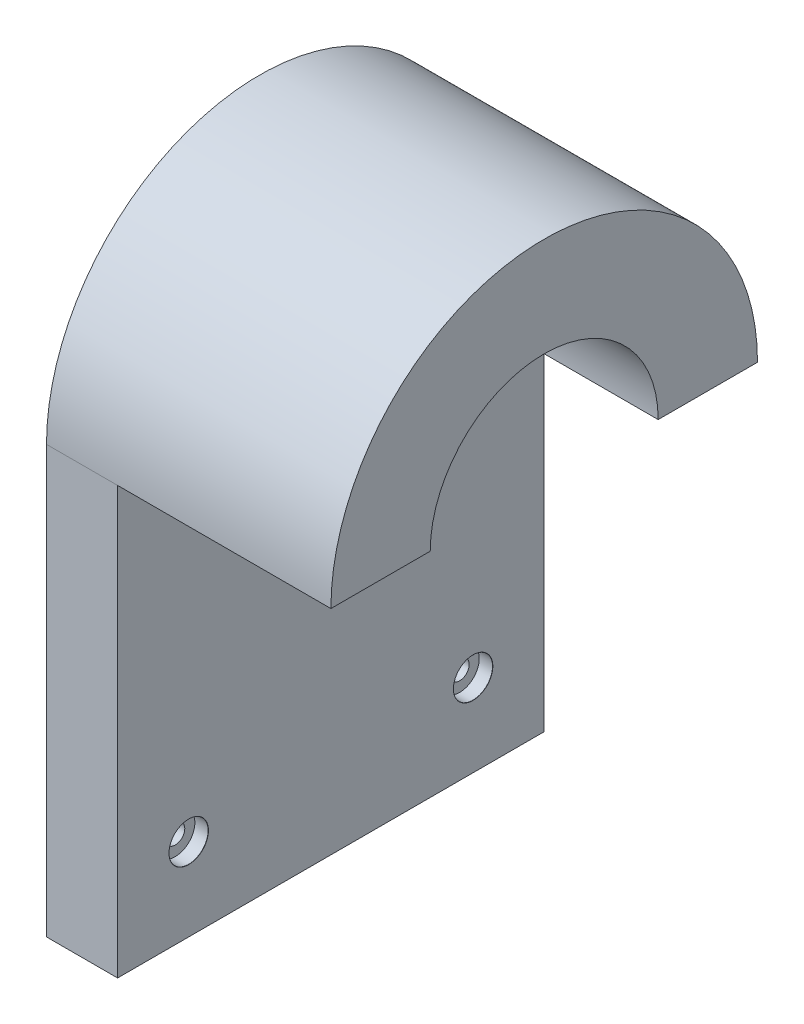
ISO-10303-21;
HEADER;
FILE_DESCRIPTION(('STEP AP214'),'2;1');
FILE_NAME('part.step','',(''),(''),'','','');
FILE_SCHEMA(('AUTOMOTIVE_DESIGN { 1 0 10303 214 1 1 1 1 }'));
ENDSEC;
DATA;
#1=APPLICATION_CONTEXT('core data for automotive mechanical design processes');
#2=APPLICATION_PROTOCOL_DEFINITION('international standard','automotive_design',2000,#1);
#3=PRODUCT_CONTEXT('',#1,'mechanical');
#4=PRODUCT('Part','Part','',(#3));
#5=PRODUCT_RELATED_PRODUCT_CATEGORY('part','',(#4));
#6=PRODUCT_DEFINITION_FORMATION('','',#4);
#7=PRODUCT_DEFINITION_CONTEXT('part definition',#1,'design');
#8=PRODUCT_DEFINITION('design','',#6,#7);
#9=PRODUCT_DEFINITION_SHAPE('','',#8);
#10=(LENGTH_UNIT() NAMED_UNIT(*) SI_UNIT(.MILLI.,.METRE.));
#11=(NAMED_UNIT(*) PLANE_ANGLE_UNIT() SI_UNIT($,.RADIAN.));
#12=(NAMED_UNIT(*) SI_UNIT($,.STERADIAN.) SOLID_ANGLE_UNIT());
#13=UNCERTAINTY_MEASURE_WITH_UNIT(LENGTH_MEASURE(1.E-05),#10,'distance_accuracy_value','');
#14=(GEOMETRIC_REPRESENTATION_CONTEXT(3) GLOBAL_UNCERTAINTY_ASSIGNED_CONTEXT((#13)) GLOBAL_UNIT_ASSIGNED_CONTEXT((#10,
#11,#12)) REPRESENTATION_CONTEXT('',''));
#15=CARTESIAN_POINT('',(0.,0.,0.));
#16=DIRECTION('',(0.,0.,1.));
#17=DIRECTION('',(1.,0.,0.));
#18=AXIS2_PLACEMENT_3D('',#15,#16,#17);
#19=CARTESIAN_POINT('',(12.7,0.,38.1));
#20=DIRECTION('',(0.,0.,-1.));
#21=DIRECTION('',(-1.,0.,0.));
#22=AXIS2_PLACEMENT_3D('',#19,#20,#21);
#23=PLANE('',#22);
#24=DIRECTION('',(0.,-1.,0.));
#25=VECTOR('',#24,1.);
#26=CARTESIAN_POINT('',(0.,0.,38.1));
#27=LINE('',#26,#25);
#28=CARTESIAN_POINT('',(0.,0.,38.1));
#29=VERTEX_POINT('',#28);
#30=CARTESIAN_POINT('',(0.,-76.2,38.1));
#31=VERTEX_POINT('',#30);
#32=EDGE_CURVE('E151',#29,#31,#27,.T.);
#33=ORIENTED_EDGE('',*,*,#32,.T.);
#34=DIRECTION('',(-1.,0.,0.));
#35=VECTOR('',#34,1.);
#36=CARTESIAN_POINT('',(12.7,-76.2,38.1));
#37=LINE('',#36,#35);
#38=CARTESIAN_POINT('',(12.7,-76.2,38.1));
#39=VERTEX_POINT('',#38);
#40=EDGE_CURVE('E59',#39,#31,#37,.T.);
#41=ORIENTED_EDGE('',*,*,#40,.F.);
#42=DIRECTION('',(0.,-1.,0.));
#43=VECTOR('',#42,1.);
#44=CARTESIAN_POINT('',(12.7,0.,38.1));
#45=LINE('',#44,#43);
#46=CARTESIAN_POINT('',(12.7,0.,38.1));
#47=VERTEX_POINT('',#46);
#48=EDGE_CURVE('E143',#47,#39,#45,.T.);
#49=ORIENTED_EDGE('',*,*,#48,.F.);
#50=DIRECTION('',(-1.,0.,0.));
#51=VECTOR('',#50,1.);
#52=CARTESIAN_POINT('',(12.7,0.,38.1));
#53=LINE('',#52,#51);
#54=EDGE_CURVE('E12',#47,#29,#53,.T.);
#55=ORIENTED_EDGE('',*,*,#54,.T.);
#56=EDGE_LOOP('',(#33,#41,#49,#55));
#57=FACE_BOUND('',#56,.T.);
#58=ADVANCED_FACE('F50',(#57),#23,.F.);
#59=CARTESIAN_POINT('',(12.7,-76.2,0.));
#60=DIRECTION('',(0.,1.,0.));
#61=DIRECTION('',(0.,0.,1.));
#62=AXIS2_PLACEMENT_3D('',#59,#60,#61);
#63=PLANE('',#62);
#64=DIRECTION('',(0.,0.,-1.));
#65=VECTOR('',#64,1.);
#66=CARTESIAN_POINT('',(0.,-76.2,0.));
#67=LINE('',#66,#65);
#68=CARTESIAN_POINT('',(0.,-76.2,-38.1));
#69=VERTEX_POINT('',#68);
#70=EDGE_CURVE('E153',#31,#69,#67,.T.);
#71=ORIENTED_EDGE('',*,*,#70,.T.);
#72=DIRECTION('',(-1.,0.,0.));
#73=VECTOR('',#72,1.);
#74=CARTESIAN_POINT('',(12.7,-76.2,-38.1));
#75=LINE('',#74,#73);
#76=CARTESIAN_POINT('',(12.7,-76.2,-38.1));
#77=VERTEX_POINT('',#76);
#78=EDGE_CURVE('E158',#77,#69,#75,.T.);
#79=ORIENTED_EDGE('',*,*,#78,.F.);
#80=DIRECTION('',(0.,0.,-1.));
#81=VECTOR('',#80,1.);
#82=CARTESIAN_POINT('',(12.7,-76.2,0.));
#83=LINE('',#82,#81);
#84=EDGE_CURVE('E145',#39,#77,#83,.T.);
#85=ORIENTED_EDGE('',*,*,#84,.F.);
#86=ORIENTED_EDGE('',*,*,#40,.T.);
#87=EDGE_LOOP('',(#71,#79,#85,#86));
#88=FACE_BOUND('',#87,.T.);
#89=ADVANCED_FACE('F166',(#88),#63,.F.);
#90=CARTESIAN_POINT('',(12.7,0.,-38.1));
#91=DIRECTION('',(0.,0.,1.));
#92=DIRECTION('',(1.,0.,0.));
#93=AXIS2_PLACEMENT_3D('',#90,#91,#92);
#94=PLANE('',#93);
#95=DIRECTION('',(0.,1.,0.));
#96=VECTOR('',#95,1.);
#97=CARTESIAN_POINT('',(0.,0.,-38.1));
#98=LINE('',#97,#96);
#99=CARTESIAN_POINT('',(0.,0.,-38.1));
#100=VERTEX_POINT('',#99);
#101=EDGE_CURVE('E146',#69,#100,#98,.T.);
#102=ORIENTED_EDGE('',*,*,#101,.T.);
#103=DIRECTION('',(-1.,0.,0.));
#104=VECTOR('',#103,1.);
#105=CARTESIAN_POINT('',(12.7,0.,-38.1));
#106=LINE('',#105,#104);
#107=CARTESIAN_POINT('',(12.7,0.,-38.1));
#108=VERTEX_POINT('',#107);
#109=EDGE_CURVE('E150',#108,#100,#106,.T.);
#110=ORIENTED_EDGE('',*,*,#109,.F.);
#111=DIRECTION('',(0.,1.,0.));
#112=VECTOR('',#111,1.);
#113=CARTESIAN_POINT('',(12.7,0.,-38.1));
#114=LINE('',#113,#112);
#115=EDGE_CURVE('E148',#77,#108,#114,.T.);
#116=ORIENTED_EDGE('',*,*,#115,.F.);
#117=ORIENTED_EDGE('',*,*,#78,.T.);
#118=EDGE_LOOP('',(#102,#110,#116,#117));
#119=FACE_BOUND('',#118,.T.);
#120=ADVANCED_FACE('F178',(#119),#94,.F.);
#121=CARTESIAN_POINT('',(0.,0.,0.));
#122=DIRECTION('',(1.,0.,0.));
#123=DIRECTION('',(0.,0.,-1.));
#124=AXIS2_PLACEMENT_3D('',#121,#122,#123);
#125=PLANE('',#124);
#126=CARTESIAN_POINT('',(0.,0.,0.));
#127=DIRECTION('',(1.,0.,0.));
#128=DIRECTION('',(0.,0.,-1.));
#129=AXIS2_PLACEMENT_3D('',#126,#127,#128);
#130=CIRCLE('',#129,1.7);
#131=CARTESIAN_POINT('',(0.,0.,-1.7));
#132=VERTEX_POINT('',#131);
#133=EDGE_CURVE('E274',#132,#132,#130,.T.);
#134=ORIENTED_EDGE('',*,*,#133,.T.);
#135=EDGE_LOOP('',(#134));
#136=FACE_BOUND('',#135,.T.);
#137=CARTESIAN_POINT('',(0.,-61.4783253893957,25.4));
#138=DIRECTION('',(1.,0.,0.));
#139=DIRECTION('',(0.,0.,-1.));
#140=AXIS2_PLACEMENT_3D('',#137,#138,#139);
#141=CIRCLE('',#140,1.7);
#142=CARTESIAN_POINT('',(0.,-61.4783253893957,23.7));
#143=VERTEX_POINT('',#142);
#144=EDGE_CURVE('E289',#143,#143,#141,.T.);
#145=ORIENTED_EDGE('',*,*,#144,.T.);
#146=EDGE_LOOP('',(#145));
#147=FACE_BOUND('',#146,.T.);
#148=CARTESIAN_POINT('',(0.,-61.4783253893957,-25.4));
#149=DIRECTION('',(1.,0.,0.));
#150=DIRECTION('',(0.,0.,-1.));
#151=AXIS2_PLACEMENT_3D('',#148,#149,#150);
#152=CIRCLE('',#151,1.7);
#153=CARTESIAN_POINT('',(0.,-61.4783253893957,-27.1));
#154=VERTEX_POINT('',#153);
#155=EDGE_CURVE('E132',#154,#154,#152,.T.);
#156=ORIENTED_EDGE('',*,*,#155,.T.);
#157=EDGE_LOOP('',(#156));
#158=FACE_BOUND('',#157,.T.);
#159=ORIENTED_EDGE('',*,*,#32,.F.);
#160=CARTESIAN_POINT('',(0.,0.,0.));
#161=DIRECTION('',(1.,0.,0.));
#162=DIRECTION('',(0.,0.,-1.));
#163=AXIS2_PLACEMENT_3D('',#160,#161,#162);
#164=CIRCLE('',#163,38.1);
#165=EDGE_CURVE('E54',#100,#29,#164,.T.);
#166=ORIENTED_EDGE('',*,*,#165,.F.);
#167=ORIENTED_EDGE('',*,*,#101,.F.);
#168=ORIENTED_EDGE('',*,*,#70,.F.);
#169=EDGE_LOOP('',(#159,#166,#167,#168));
#170=FACE_BOUND('',#169,.T.);
#171=ADVANCED_FACE('F173',(#136,#147,#158,#170),#125,.F.);
#172=CARTESIAN_POINT('',(12.7,0.,0.));
#173=DIRECTION('',(1.,0.,0.));
#174=DIRECTION('',(0.,0.,-1.));
#175=AXIS2_PLACEMENT_3D('',#172,#173,#174);
#176=PLANE('',#175);
#177=CARTESIAN_POINT('',(12.7,0.,0.));
#178=DIRECTION('',(1.,0.,0.));
#179=DIRECTION('',(0.,0.,-1.));
#180=AXIS2_PLACEMENT_3D('',#177,#178,#179);
#181=CIRCLE('',#180,3.525);
#182=CARTESIAN_POINT('',(12.7,0.,-3.525));
#183=VERTEX_POINT('',#182);
#184=EDGE_CURVE('E264',#183,#183,#181,.T.);
#185=ORIENTED_EDGE('',*,*,#184,.F.);
#186=EDGE_LOOP('',(#185));
#187=FACE_BOUND('',#186,.T.);
#188=CARTESIAN_POINT('',(12.7,-61.4783253893957,25.4));
#189=DIRECTION('',(1.,0.,0.));
#190=DIRECTION('',(0.,0.,-1.));
#191=AXIS2_PLACEMENT_3D('',#188,#189,#190);
#192=CIRCLE('',#191,3.525);
#193=CARTESIAN_POINT('',(12.7,-61.4783253893957,21.875));
#194=VERTEX_POINT('',#193);
#195=EDGE_CURVE('E277',#194,#194,#192,.T.);
#196=ORIENTED_EDGE('',*,*,#195,.F.);
#197=EDGE_LOOP('',(#196));
#198=FACE_BOUND('',#197,.T.);
#199=CARTESIAN_POINT('',(12.7,-61.4783253893957,-25.4));
#200=DIRECTION('',(1.,0.,0.));
#201=DIRECTION('',(0.,0.,-1.));
#202=AXIS2_PLACEMENT_3D('',#199,#200,#201);
#203=CIRCLE('',#202,3.525);
#204=CARTESIAN_POINT('',(12.7,-61.4783253893957,-28.925));
#205=VERTEX_POINT('',#204);
#206=EDGE_CURVE('E292',#205,#205,#203,.T.);
#207=ORIENTED_EDGE('',*,*,#206,.F.);
#208=EDGE_LOOP('',(#207));
#209=FACE_BOUND('',#208,.T.);
#210=DIRECTION('',(0.,0.,-1.));
#211=VECTOR('',#210,1.);
#212=CARTESIAN_POINT('',(12.7,0.,0.));
#213=LINE('',#212,#211);
#214=CARTESIAN_POINT('',(12.7,0.,20.3583896772897));
#215=VERTEX_POINT('',#214);
#216=EDGE_CURVE('E127',#47,#215,#213,.T.);
#217=ORIENTED_EDGE('',*,*,#216,.F.);
#218=ORIENTED_EDGE('',*,*,#48,.T.);
#219=ORIENTED_EDGE('',*,*,#84,.T.);
#220=ORIENTED_EDGE('',*,*,#115,.T.);
#221=CARTESIAN_POINT('',(12.7,0.,-20.3583896772897));
#222=VERTEX_POINT('',#221);
#223=EDGE_CURVE('E71',#222,#108,#213,.T.);
#224=ORIENTED_EDGE('',*,*,#223,.F.);
#225=CARTESIAN_POINT('',(12.7,0.,0.));
#226=DIRECTION('',(1.,0.,0.));
#227=DIRECTION('',(0.,0.,-1.));
#228=AXIS2_PLACEMENT_3D('',#225,#226,#227);
#229=CIRCLE('',#228,20.3583896772897);
#230=EDGE_CURVE('E66',#222,#215,#229,.T.);
#231=ORIENTED_EDGE('',*,*,#230,.T.);
#232=EDGE_LOOP('',(#217,#218,#219,#220,#224,#231));
#233=FACE_BOUND('',#232,.T.);
#234=ADVANCED_FACE('F180',(#187,#198,#209,#233),#176,.T.);
#235=CARTESIAN_POINT('',(12.7,0.,0.));
#236=DIRECTION('',(-1.,0.,0.));
#237=DIRECTION('',(0.,0.,1.));
#238=AXIS2_PLACEMENT_3D('',#235,#236,#237);
#239=CYLINDRICAL_SURFACE('',#238,38.1);
#240=ORIENTED_EDGE('',*,*,#165,.T.);
#241=ORIENTED_EDGE('',*,*,#54,.F.);
#242=DIRECTION('',(-1.,0.,0.));
#243=VECTOR('',#242,1.);
#244=CARTESIAN_POINT('',(50.8,0.,38.1));
#245=LINE('',#244,#243);
#246=CARTESIAN_POINT('',(50.8,0.,38.1));
#247=VERTEX_POINT('',#246);
#248=EDGE_CURVE('E139',#247,#47,#245,.T.);
#249=ORIENTED_EDGE('',*,*,#248,.F.);
#250=CARTESIAN_POINT('',(50.8,0.,0.));
#251=DIRECTION('',(1.,0.,0.));
#252=DIRECTION('',(0.,0.,-1.));
#253=AXIS2_PLACEMENT_3D('',#250,#251,#252);
#254=CIRCLE('',#253,38.1);
#255=CARTESIAN_POINT('',(50.8,0.,-38.1));
#256=VERTEX_POINT('',#255);
#257=EDGE_CURVE('E121',#256,#247,#254,.T.);
#258=ORIENTED_EDGE('',*,*,#257,.F.);
#259=DIRECTION('',(-1.,0.,0.));
#260=VECTOR('',#259,1.);
#261=CARTESIAN_POINT('',(50.8,0.,-38.1));
#262=LINE('',#261,#260);
#263=EDGE_CURVE('E113',#256,#108,#262,.T.);
#264=ORIENTED_EDGE('',*,*,#263,.T.);
#265=ORIENTED_EDGE('',*,*,#109,.T.);
#266=EDGE_LOOP('',(#240,#241,#249,#258,#264,#265));
#267=FACE_BOUND('',#266,.T.);
#268=ADVANCED_FACE('F52',(#267),#239,.T.);
#269=CARTESIAN_POINT('',(50.8,0.,0.));
#270=DIRECTION('',(-1.,0.,0.));
#271=DIRECTION('',(0.,0.,1.));
#272=AXIS2_PLACEMENT_3D('',#269,#270,#271);
#273=CYLINDRICAL_SURFACE('',#272,20.3583896772897);
#274=ORIENTED_EDGE('',*,*,#230,.F.);
#275=DIRECTION('',(-1.,0.,0.));
#276=VECTOR('',#275,1.);
#277=CARTESIAN_POINT('',(50.8,0.,-20.3583896772897));
#278=LINE('',#277,#276);
#279=CARTESIAN_POINT('',(50.8,0.,-20.3583896772897));
#280=VERTEX_POINT('',#279);
#281=EDGE_CURVE('E107',#280,#222,#278,.T.);
#282=ORIENTED_EDGE('',*,*,#281,.F.);
#283=CARTESIAN_POINT('',(50.8,0.,0.));
#284=DIRECTION('',(1.,0.,0.));
#285=DIRECTION('',(0.,0.,-1.));
#286=AXIS2_PLACEMENT_3D('',#283,#284,#285);
#287=CIRCLE('',#286,20.3583896772897);
#288=CARTESIAN_POINT('',(50.8,0.,20.3583896772897));
#289=VERTEX_POINT('',#288);
#290=EDGE_CURVE('E111',#280,#289,#287,.T.);
#291=ORIENTED_EDGE('',*,*,#290,.T.);
#292=DIRECTION('',(-1.,0.,0.));
#293=VECTOR('',#292,1.);
#294=CARTESIAN_POINT('',(50.8,0.,20.3583896772897));
#295=LINE('',#294,#293);
#296=EDGE_CURVE('E137',#289,#215,#295,.T.);
#297=ORIENTED_EDGE('',*,*,#296,.T.);
#298=EDGE_LOOP('',(#274,#282,#291,#297));
#299=FACE_BOUND('',#298,.T.);
#300=ADVANCED_FACE('F109',(#299),#273,.F.);
#301=CARTESIAN_POINT('',(50.8,0.,0.));
#302=DIRECTION('',(0.,1.,0.));
#303=DIRECTION('',(0.,0.,1.));
#304=AXIS2_PLACEMENT_3D('',#301,#302,#303);
#305=PLANE('',#304);
#306=ORIENTED_EDGE('',*,*,#223,.T.);
#307=ORIENTED_EDGE('',*,*,#263,.F.);
#308=DIRECTION('',(0.,0.,-1.));
#309=VECTOR('',#308,1.);
#310=CARTESIAN_POINT('',(50.8,0.,0.));
#311=LINE('',#310,#309);
#312=EDGE_CURVE('E116',#280,#256,#311,.T.);
#313=ORIENTED_EDGE('',*,*,#312,.F.);
#314=ORIENTED_EDGE('',*,*,#281,.T.);
#315=EDGE_LOOP('',(#306,#307,#313,#314));
#316=FACE_BOUND('',#315,.T.);
#317=ADVANCED_FACE('F117',(#316),#305,.F.);
#318=ORIENTED_EDGE('',*,*,#216,.T.);
#319=ORIENTED_EDGE('',*,*,#296,.F.);
#320=EDGE_CURVE('E123',#247,#289,#311,.T.);
#321=ORIENTED_EDGE('',*,*,#320,.F.);
#322=ORIENTED_EDGE('',*,*,#248,.T.);
#323=EDGE_LOOP('',(#318,#319,#321,#322));
#324=FACE_BOUND('',#323,.T.);
#325=ADVANCED_FACE('F184',(#324),#305,.F.);
#326=CARTESIAN_POINT('',(50.8,0.,0.));
#327=DIRECTION('',(1.,0.,0.));
#328=DIRECTION('',(0.,0.,-1.));
#329=AXIS2_PLACEMENT_3D('',#326,#327,#328);
#330=PLANE('',#329);
#331=ORIENTED_EDGE('',*,*,#290,.F.);
#332=ORIENTED_EDGE('',*,*,#312,.T.);
#333=ORIENTED_EDGE('',*,*,#257,.T.);
#334=ORIENTED_EDGE('',*,*,#320,.T.);
#335=EDGE_LOOP('',(#331,#332,#333,#334));
#336=FACE_BOUND('',#335,.T.);
#337=ADVANCED_FACE('F124',(#336),#330,.T.);
#338=CARTESIAN_POINT('',(12.7,-61.4783253893957,-25.4));
#339=DIRECTION('',(1.,0.,0.));
#340=DIRECTION('',(0.,0.,-1.));
#341=AXIS2_PLACEMENT_3D('',#338,#339,#340);
#342=CYLINDRICAL_SURFACE('',#341,1.7);
#343=ORIENTED_EDGE('',*,*,#155,.F.);
#344=EDGE_LOOP('',(#343));
#345=FACE_BOUND('',#344,.T.);
#346=CARTESIAN_POINT('',(10.3,-61.4783253893957,-25.4));
#347=DIRECTION('',(1.,0.,0.));
#348=DIRECTION('',(0.,0.,-1.));
#349=AXIS2_PLACEMENT_3D('',#346,#347,#348);
#350=CIRCLE('',#349,1.7);
#351=CARTESIAN_POINT('',(10.3,-61.4783253893957,-27.1));
#352=VERTEX_POINT('',#351);
#353=EDGE_CURVE('E300',#352,#352,#350,.T.);
#354=ORIENTED_EDGE('',*,*,#353,.T.);
#355=EDGE_LOOP('',(#354));
#356=FACE_BOUND('',#355,.T.);
#357=ADVANCED_FACE('F209',(#345,#356),#342,.F.);
#358=CARTESIAN_POINT('',(10.3,-57.9783253893957,-25.4));
#359=DIRECTION('',(-1.,0.,0.));
#360=DIRECTION('',(0.,0.,1.));
#361=AXIS2_PLACEMENT_3D('',#358,#359,#360);
#362=PLANE('',#361);
#363=ORIENTED_EDGE('',*,*,#353,.F.);
#364=EDGE_LOOP('',(#363));
#365=FACE_BOUND('',#364,.T.);
#366=CARTESIAN_POINT('',(10.3,-61.4783253893957,-25.4));
#367=DIRECTION('',(1.,0.,0.));
#368=DIRECTION('',(0.,0.,-1.));
#369=AXIS2_PLACEMENT_3D('',#366,#367,#368);
#370=CIRCLE('',#369,3.5);
#371=CARTESIAN_POINT('',(10.3,-61.4783253893957,-28.9));
#372=VERTEX_POINT('',#371);
#373=EDGE_CURVE('E298',#372,#372,#370,.T.);
#374=ORIENTED_EDGE('',*,*,#373,.T.);
#375=EDGE_LOOP('',(#374));
#376=FACE_BOUND('',#375,.T.);
#377=ADVANCED_FACE('F212',(#365,#376),#362,.F.);
#378=CARTESIAN_POINT('',(12.7,-61.4783253893957,-25.4));
#379=DIRECTION('',(1.,0.,0.));
#380=DIRECTION('',(0.,0.,-1.));
#381=AXIS2_PLACEMENT_3D('',#378,#379,#380);
#382=CYLINDRICAL_SURFACE('',#381,3.5);
#383=ORIENTED_EDGE('',*,*,#373,.F.);
#384=EDGE_LOOP('',(#383));
#385=FACE_BOUND('',#384,.T.);
#386=CARTESIAN_POINT('',(12.675,-61.4783253893957,-25.4));
#387=DIRECTION('',(1.,0.,0.));
#388=DIRECTION('',(0.,0.,-1.));
#389=AXIS2_PLACEMENT_3D('',#386,#387,#388);
#390=CIRCLE('',#389,3.5);
#391=CARTESIAN_POINT('',(12.675,-61.4783253893957,-28.9));
#392=VERTEX_POINT('',#391);
#393=EDGE_CURVE('E295',#392,#392,#390,.T.);
#394=ORIENTED_EDGE('',*,*,#393,.T.);
#395=EDGE_LOOP('',(#394));
#396=FACE_BOUND('',#395,.T.);
#397=ADVANCED_FACE('F216',(#385,#396),#382,.F.);
#398=CARTESIAN_POINT('',(12.7,-61.4783253893957,-25.4));
#399=DIRECTION('',(1.,0.,0.));
#400=DIRECTION('',(0.,0.,-1.));
#401=AXIS2_PLACEMENT_3D('',#398,#399,#400);
#402=CONICAL_SURFACE('',#401,3.525,0.785398163397518);
#403=ORIENTED_EDGE('',*,*,#393,.F.);
#404=EDGE_LOOP('',(#403));
#405=FACE_BOUND('',#404,.T.);
#406=ORIENTED_EDGE('',*,*,#206,.T.);
#407=EDGE_LOOP('',(#406));
#408=FACE_BOUND('',#407,.T.);
#409=ADVANCED_FACE('F220',(#405,#408),#402,.F.);
#410=CARTESIAN_POINT('',(12.7,-61.4783253893957,25.4));
#411=DIRECTION('',(1.,0.,0.));
#412=DIRECTION('',(0.,0.,-1.));
#413=AXIS2_PLACEMENT_3D('',#410,#411,#412);
#414=CYLINDRICAL_SURFACE('',#413,1.7);
#415=ORIENTED_EDGE('',*,*,#144,.F.);
#416=EDGE_LOOP('',(#415));
#417=FACE_BOUND('',#416,.T.);
#418=CARTESIAN_POINT('',(10.3,-61.4783253893957,25.4));
#419=DIRECTION('',(1.,0.,0.));
#420=DIRECTION('',(0.,0.,-1.));
#421=AXIS2_PLACEMENT_3D('',#418,#419,#420);
#422=CIRCLE('',#421,1.7);
#423=CARTESIAN_POINT('',(10.3,-61.4783253893957,23.7));
#424=VERTEX_POINT('',#423);
#425=EDGE_CURVE('E286',#424,#424,#422,.T.);
#426=ORIENTED_EDGE('',*,*,#425,.T.);
#427=EDGE_LOOP('',(#426));
#428=FACE_BOUND('',#427,.T.);
#429=ADVANCED_FACE('F224',(#417,#428),#414,.F.);
#430=CARTESIAN_POINT('',(10.3,-57.9783253893957,25.4));
#431=DIRECTION('',(-1.,0.,0.));
#432=DIRECTION('',(0.,0.,1.));
#433=AXIS2_PLACEMENT_3D('',#430,#431,#432);
#434=PLANE('',#433);
#435=ORIENTED_EDGE('',*,*,#425,.F.);
#436=EDGE_LOOP('',(#435));
#437=FACE_BOUND('',#436,.T.);
#438=CARTESIAN_POINT('',(10.3,-61.4783253893957,25.4));
#439=DIRECTION('',(1.,0.,0.));
#440=DIRECTION('',(0.,0.,-1.));
#441=AXIS2_PLACEMENT_3D('',#438,#439,#440);
#442=CIRCLE('',#441,3.5);
#443=CARTESIAN_POINT('',(10.3,-61.4783253893957,21.9));
#444=VERTEX_POINT('',#443);
#445=EDGE_CURVE('E283',#444,#444,#442,.T.);
#446=ORIENTED_EDGE('',*,*,#445,.T.);
#447=EDGE_LOOP('',(#446));
#448=FACE_BOUND('',#447,.T.);
#449=ADVANCED_FACE('F228',(#437,#448),#434,.F.);
#450=CARTESIAN_POINT('',(12.7,-61.4783253893957,25.4));
#451=DIRECTION('',(1.,0.,0.));
#452=DIRECTION('',(0.,0.,-1.));
#453=AXIS2_PLACEMENT_3D('',#450,#451,#452);
#454=CYLINDRICAL_SURFACE('',#453,3.5);
#455=ORIENTED_EDGE('',*,*,#445,.F.);
#456=EDGE_LOOP('',(#455));
#457=FACE_BOUND('',#456,.T.);
#458=CARTESIAN_POINT('',(12.675,-61.4783253893957,25.4));
#459=DIRECTION('',(1.,0.,0.));
#460=DIRECTION('',(0.,0.,-1.));
#461=AXIS2_PLACEMENT_3D('',#458,#459,#460);
#462=CIRCLE('',#461,3.5);
#463=CARTESIAN_POINT('',(12.675,-61.4783253893957,21.9));
#464=VERTEX_POINT('',#463);
#465=EDGE_CURVE('E280',#464,#464,#462,.T.);
#466=ORIENTED_EDGE('',*,*,#465,.T.);
#467=EDGE_LOOP('',(#466));
#468=FACE_BOUND('',#467,.T.);
#469=ADVANCED_FACE('F232',(#457,#468),#454,.F.);
#470=CARTESIAN_POINT('',(12.7,-61.4783253893957,25.4));
#471=DIRECTION('',(1.,0.,0.));
#472=DIRECTION('',(0.,0.,-1.));
#473=AXIS2_PLACEMENT_3D('',#470,#471,#472);
#474=CONICAL_SURFACE('',#473,3.525,0.785398163397518);
#475=ORIENTED_EDGE('',*,*,#465,.F.);
#476=EDGE_LOOP('',(#475));
#477=FACE_BOUND('',#476,.T.);
#478=ORIENTED_EDGE('',*,*,#195,.T.);
#479=EDGE_LOOP('',(#478));
#480=FACE_BOUND('',#479,.T.);
#481=ADVANCED_FACE('F236',(#477,#480),#474,.F.);
#482=CARTESIAN_POINT('',(12.7,0.,0.));
#483=DIRECTION('',(1.,0.,0.));
#484=DIRECTION('',(0.,0.,-1.));
#485=AXIS2_PLACEMENT_3D('',#482,#483,#484);
#486=CYLINDRICAL_SURFACE('',#485,1.7);
#487=ORIENTED_EDGE('',*,*,#133,.F.);
#488=EDGE_LOOP('',(#487));
#489=FACE_BOUND('',#488,.T.);
#490=CARTESIAN_POINT('',(10.3,0.,0.));
#491=DIRECTION('',(1.,0.,0.));
#492=DIRECTION('',(0.,0.,-1.));
#493=AXIS2_PLACEMENT_3D('',#490,#491,#492);
#494=CIRCLE('',#493,1.7);
#495=CARTESIAN_POINT('',(10.3,0.,-1.7));
#496=VERTEX_POINT('',#495);
#497=EDGE_CURVE('E271',#496,#496,#494,.T.);
#498=ORIENTED_EDGE('',*,*,#497,.T.);
#499=EDGE_LOOP('',(#498));
#500=FACE_BOUND('',#499,.T.);
#501=ADVANCED_FACE('F240',(#489,#500),#486,.F.);
#502=CARTESIAN_POINT('',(10.3,3.5,0.));
#503=DIRECTION('',(-1.,0.,0.));
#504=DIRECTION('',(0.,0.,1.));
#505=AXIS2_PLACEMENT_3D('',#502,#503,#504);
#506=PLANE('',#505);
#507=ORIENTED_EDGE('',*,*,#497,.F.);
#508=EDGE_LOOP('',(#507));
#509=FACE_BOUND('',#508,.T.);
#510=CARTESIAN_POINT('',(10.3,0.,0.));
#511=DIRECTION('',(1.,0.,0.));
#512=DIRECTION('',(0.,0.,-1.));
#513=AXIS2_PLACEMENT_3D('',#510,#511,#512);
#514=CIRCLE('',#513,3.5);
#515=CARTESIAN_POINT('',(10.3,0.,-3.5));
#516=VERTEX_POINT('',#515);
#517=EDGE_CURVE('E266',#516,#516,#514,.T.);
#518=ORIENTED_EDGE('',*,*,#517,.T.);
#519=EDGE_LOOP('',(#518));
#520=FACE_BOUND('',#519,.T.);
#521=ADVANCED_FACE('F244',(#509,#520),#506,.F.);
#522=CARTESIAN_POINT('',(12.7,0.,0.));
#523=DIRECTION('',(1.,0.,0.));
#524=DIRECTION('',(0.,0.,-1.));
#525=AXIS2_PLACEMENT_3D('',#522,#523,#524);
#526=CYLINDRICAL_SURFACE('',#525,3.5);
#527=ORIENTED_EDGE('',*,*,#517,.F.);
#528=EDGE_LOOP('',(#527));
#529=FACE_BOUND('',#528,.T.);
#530=CARTESIAN_POINT('',(12.675,0.,0.));
#531=DIRECTION('',(1.,0.,0.));
#532=DIRECTION('',(0.,0.,-1.));
#533=AXIS2_PLACEMENT_3D('',#530,#531,#532);
#534=CIRCLE('',#533,3.5);
#535=CARTESIAN_POINT('',(12.675,0.,-3.5));
#536=VERTEX_POINT('',#535);
#537=EDGE_CURVE('E261',#536,#536,#534,.T.);
#538=ORIENTED_EDGE('',*,*,#537,.T.);
#539=EDGE_LOOP('',(#538));
#540=FACE_BOUND('',#539,.T.);
#541=ADVANCED_FACE('F248',(#529,#540),#526,.F.);
#542=CARTESIAN_POINT('',(12.7,0.,0.));
#543=DIRECTION('',(1.,0.,0.));
#544=DIRECTION('',(0.,0.,-1.));
#545=AXIS2_PLACEMENT_3D('',#542,#543,#544);
#546=CONICAL_SURFACE('',#545,3.525,0.785398163397448);
#547=ORIENTED_EDGE('',*,*,#537,.F.);
#548=EDGE_LOOP('',(#547));
#549=FACE_BOUND('',#548,.T.);
#550=ORIENTED_EDGE('',*,*,#184,.T.);
#551=EDGE_LOOP('',(#550));
#552=FACE_BOUND('',#551,.T.);
#553=ADVANCED_FACE('F252',(#549,#552),#546,.F.);
#554=CLOSED_SHELL('',(#58,#89,#120,#171,#234,#268,#300,#317,#325,#337,#357,#377,#397,#409,#429,
#449,#469,#481,#501,#521,#541,#553));
#555=MANIFOLD_SOLID_BREP('B2',#554);
#556=ADVANCED_BREP_SHAPE_REPRESENTATION('',(#18,#555),#14);
#557=SHAPE_DEFINITION_REPRESENTATION(#9,#556);
ENDSEC;
END-ISO-10303-21;
